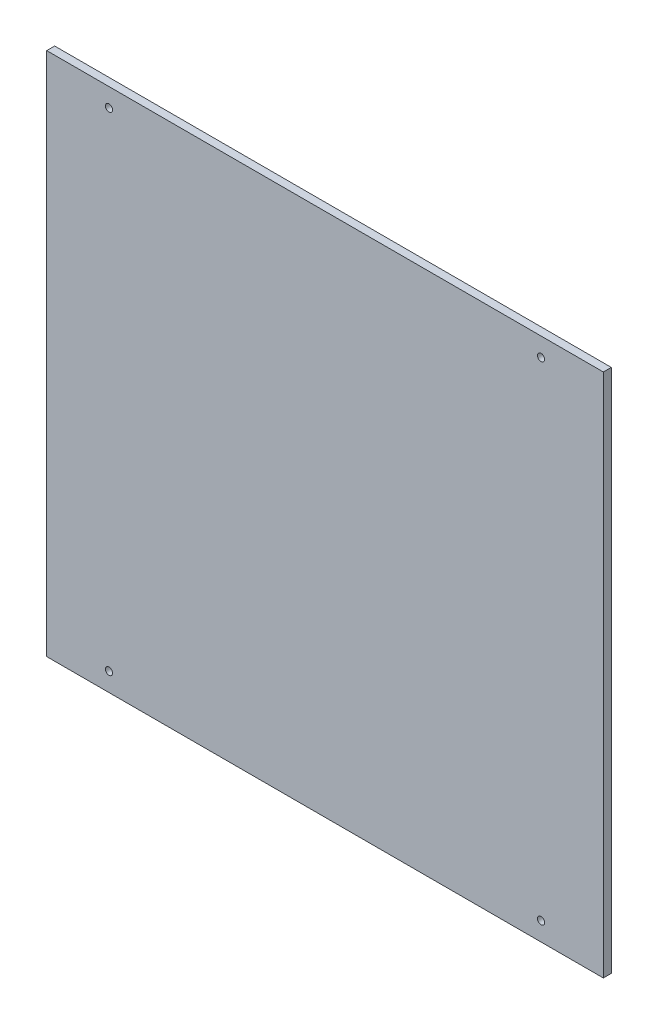
ISO-10303-21;
HEADER;
FILE_DESCRIPTION(('STEP AP214'),'2;1');
FILE_NAME('part.step','',(''),(''),'','','');
FILE_SCHEMA(('AUTOMOTIVE_DESIGN { 1 0 10303 214 1 1 1 1 }'));
ENDSEC;
DATA;
#1=APPLICATION_CONTEXT('core data for automotive mechanical design processes');
#2=APPLICATION_PROTOCOL_DEFINITION('international standard','automotive_design',2000,#1);
#3=PRODUCT_CONTEXT('',#1,'mechanical');
#4=PRODUCT('Part','Part','',(#3));
#5=PRODUCT_RELATED_PRODUCT_CATEGORY('part','',(#4));
#6=PRODUCT_DEFINITION_FORMATION('','',#4);
#7=PRODUCT_DEFINITION_CONTEXT('part definition',#1,'design');
#8=PRODUCT_DEFINITION('design','',#6,#7);
#9=PRODUCT_DEFINITION_SHAPE('','',#8);
#10=(LENGTH_UNIT() NAMED_UNIT(*) SI_UNIT(.MILLI.,.METRE.));
#11=(NAMED_UNIT(*) PLANE_ANGLE_UNIT() SI_UNIT($,.RADIAN.));
#12=(NAMED_UNIT(*) SI_UNIT($,.STERADIAN.) SOLID_ANGLE_UNIT());
#13=UNCERTAINTY_MEASURE_WITH_UNIT(LENGTH_MEASURE(1.E-05),#10,'distance_accuracy_value','');
#14=(GEOMETRIC_REPRESENTATION_CONTEXT(3) GLOBAL_UNCERTAINTY_ASSIGNED_CONTEXT((#13)) GLOBAL_UNIT_ASSIGNED_CONTEXT((#10,
#11,#12)) REPRESENTATION_CONTEXT('',''));
#15=CARTESIAN_POINT('',(0.,0.,0.));
#16=DIRECTION('',(0.,0.,1.));
#17=DIRECTION('',(1.,0.,0.));
#18=AXIS2_PLACEMENT_3D('',#15,#16,#17);
#19=CARTESIAN_POINT('',(105.,99.,3.));
#20=DIRECTION('',(-1.,0.,0.));
#21=DIRECTION('',(0.,-1.,0.));
#22=AXIS2_PLACEMENT_3D('',#19,#20,#21);
#23=PLANE('',#22);
#24=DIRECTION('',(0.,1.,0.));
#25=VECTOR('',#24,1.);
#26=CARTESIAN_POINT('',(105.,99.,0.));
#27=LINE('',#26,#25);
#28=CARTESIAN_POINT('',(105.,-99.,0.));
#29=VERTEX_POINT('',#28);
#30=CARTESIAN_POINT('',(105.,99.,0.));
#31=VERTEX_POINT('',#30);
#32=EDGE_CURVE('E96',#29,#31,#27,.T.);
#33=ORIENTED_EDGE('',*,*,#32,.T.);
#34=DIRECTION('',(0.,0.,-1.));
#35=VECTOR('',#34,1.);
#36=CARTESIAN_POINT('',(105.,99.,3.));
#37=LINE('',#36,#35);
#38=CARTESIAN_POINT('',(105.,99.,3.));
#39=VERTEX_POINT('',#38);
#40=EDGE_CURVE('E11',#39,#31,#37,.T.);
#41=ORIENTED_EDGE('',*,*,#40,.F.);
#42=DIRECTION('',(0.,1.,0.));
#43=VECTOR('',#42,1.);
#44=CARTESIAN_POINT('',(105.,99.,3.));
#45=LINE('',#44,#43);
#46=CARTESIAN_POINT('',(105.,-99.,3.));
#47=VERTEX_POINT('',#46);
#48=EDGE_CURVE('E84',#47,#39,#45,.T.);
#49=ORIENTED_EDGE('',*,*,#48,.F.);
#50=DIRECTION('',(0.,0.,-1.));
#51=VECTOR('',#50,1.);
#52=CARTESIAN_POINT('',(105.,-99.,3.));
#53=LINE('',#52,#51);
#54=EDGE_CURVE('E92',#47,#29,#53,.T.);
#55=ORIENTED_EDGE('',*,*,#54,.T.);
#56=EDGE_LOOP('',(#33,#41,#49,#55));
#57=FACE_BOUND('',#56,.T.);
#58=ADVANCED_FACE('F33',(#57),#23,.F.);
#59=CARTESIAN_POINT('',(-105.,99.,3.));
#60=DIRECTION('',(0.,-1.,0.));
#61=DIRECTION('',(0.,0.,-1.));
#62=AXIS2_PLACEMENT_3D('',#59,#60,#61);
#63=PLANE('',#62);
#64=DIRECTION('',(-1.,0.,0.));
#65=VECTOR('',#64,1.);
#66=CARTESIAN_POINT('',(-105.,99.,0.));
#67=LINE('',#66,#65);
#68=CARTESIAN_POINT('',(-105.,99.,0.));
#69=VERTEX_POINT('',#68);
#70=EDGE_CURVE('E88',#31,#69,#67,.T.);
#71=ORIENTED_EDGE('',*,*,#70,.T.);
#72=DIRECTION('',(0.,0.,-1.));
#73=VECTOR('',#72,1.);
#74=CARTESIAN_POINT('',(-105.,99.,3.));
#75=LINE('',#74,#73);
#76=CARTESIAN_POINT('',(-105.,99.,3.));
#77=VERTEX_POINT('',#76);
#78=EDGE_CURVE('E41',#77,#69,#75,.T.);
#79=ORIENTED_EDGE('',*,*,#78,.F.);
#80=DIRECTION('',(-1.,0.,0.));
#81=VECTOR('',#80,1.);
#82=CARTESIAN_POINT('',(-105.,99.,3.));
#83=LINE('',#82,#81);
#84=EDGE_CURVE('E79',#39,#77,#83,.T.);
#85=ORIENTED_EDGE('',*,*,#84,.F.);
#86=ORIENTED_EDGE('',*,*,#40,.T.);
#87=EDGE_LOOP('',(#71,#79,#85,#86));
#88=FACE_BOUND('',#87,.T.);
#89=ADVANCED_FACE('F87',(#88),#63,.F.);
#90=CARTESIAN_POINT('',(-105.,99.,3.));
#91=DIRECTION('',(1.,0.,0.));
#92=DIRECTION('',(0.,1.,0.));
#93=AXIS2_PLACEMENT_3D('',#90,#91,#92);
#94=PLANE('',#93);
#95=DIRECTION('',(0.,-1.,0.));
#96=VECTOR('',#95,1.);
#97=CARTESIAN_POINT('',(-105.,99.,0.));
#98=LINE('',#97,#96);
#99=CARTESIAN_POINT('',(-105.,-99.,0.));
#100=VERTEX_POINT('',#99);
#101=EDGE_CURVE('E66',#69,#100,#98,.T.);
#102=ORIENTED_EDGE('',*,*,#101,.T.);
#103=DIRECTION('',(0.,0.,-1.));
#104=VECTOR('',#103,1.);
#105=CARTESIAN_POINT('',(-105.,-99.,3.));
#106=LINE('',#105,#104);
#107=CARTESIAN_POINT('',(-105.,-99.,3.));
#108=VERTEX_POINT('',#107);
#109=EDGE_CURVE('E89',#108,#100,#106,.T.);
#110=ORIENTED_EDGE('',*,*,#109,.F.);
#111=DIRECTION('',(0.,-1.,0.));
#112=VECTOR('',#111,1.);
#113=CARTESIAN_POINT('',(-105.,99.,3.));
#114=LINE('',#113,#112);
#115=EDGE_CURVE('E82',#77,#108,#114,.T.);
#116=ORIENTED_EDGE('',*,*,#115,.F.);
#117=ORIENTED_EDGE('',*,*,#78,.T.);
#118=EDGE_LOOP('',(#102,#110,#116,#117));
#119=FACE_BOUND('',#118,.T.);
#120=ADVANCED_FACE('F90',(#119),#94,.F.);
#121=CARTESIAN_POINT('',(-105.,-99.,3.));
#122=DIRECTION('',(0.,1.,0.));
#123=DIRECTION('',(0.,0.,1.));
#124=AXIS2_PLACEMENT_3D('',#121,#122,#123);
#125=PLANE('',#124);
#126=DIRECTION('',(1.,0.,0.));
#127=VECTOR('',#126,1.);
#128=CARTESIAN_POINT('',(-105.,-99.,0.));
#129=LINE('',#128,#127);
#130=EDGE_CURVE('E72',#100,#29,#129,.T.);
#131=ORIENTED_EDGE('',*,*,#130,.T.);
#132=ORIENTED_EDGE('',*,*,#54,.F.);
#133=DIRECTION('',(1.,0.,0.));
#134=VECTOR('',#133,1.);
#135=CARTESIAN_POINT('',(-105.,-99.,3.));
#136=LINE('',#135,#134);
#137=EDGE_CURVE('E49',#108,#47,#136,.T.);
#138=ORIENTED_EDGE('',*,*,#137,.F.);
#139=ORIENTED_EDGE('',*,*,#109,.T.);
#140=EDGE_LOOP('',(#131,#132,#138,#139));
#141=FACE_BOUND('',#140,.T.);
#142=ADVANCED_FACE('F104',(#141),#125,.F.);
#143=CARTESIAN_POINT('',(0.,0.,3.));
#144=DIRECTION('',(0.,0.,1.));
#145=DIRECTION('',(1.,0.,0.));
#146=AXIS2_PLACEMENT_3D('',#143,#144,#145);
#147=PLANE('',#146);
#148=CARTESIAN_POINT('',(-81.5,-92.,3.));
#149=DIRECTION('',(0.,0.,1.));
#150=DIRECTION('',(1.,0.,0.));
#151=AXIS2_PLACEMENT_3D('',#148,#149,#150);
#152=CIRCLE('',#151,1.34999999999999);
#153=CARTESIAN_POINT('',(-80.15,-92.,3.));
#154=VERTEX_POINT('',#153);
#155=EDGE_CURVE('E130',#154,#154,#152,.T.);
#156=ORIENTED_EDGE('',*,*,#155,.F.);
#157=EDGE_LOOP('',(#156));
#158=FACE_BOUND('',#157,.T.);
#159=CARTESIAN_POINT('',(-81.5,92.,3.));
#160=DIRECTION('',(0.,0.,1.));
#161=DIRECTION('',(1.,0.,0.));
#162=AXIS2_PLACEMENT_3D('',#159,#160,#161);
#163=CIRCLE('',#162,1.34999999999999);
#164=CARTESIAN_POINT('',(-80.15,92.,3.));
#165=VERTEX_POINT('',#164);
#166=EDGE_CURVE('E124',#165,#165,#163,.T.);
#167=ORIENTED_EDGE('',*,*,#166,.F.);
#168=EDGE_LOOP('',(#167));
#169=FACE_BOUND('',#168,.T.);
#170=CARTESIAN_POINT('',(81.5,92.,3.));
#171=DIRECTION('',(0.,0.,1.));
#172=DIRECTION('',(1.,0.,0.));
#173=AXIS2_PLACEMENT_3D('',#170,#171,#172);
#174=CIRCLE('',#173,1.34999999999999);
#175=CARTESIAN_POINT('',(82.85,92.,3.));
#176=VERTEX_POINT('',#175);
#177=EDGE_CURVE('E118',#176,#176,#174,.T.);
#178=ORIENTED_EDGE('',*,*,#177,.F.);
#179=EDGE_LOOP('',(#178));
#180=FACE_BOUND('',#179,.T.);
#181=CARTESIAN_POINT('',(81.5,-92.,3.));
#182=DIRECTION('',(0.,0.,1.));
#183=DIRECTION('',(1.,0.,0.));
#184=AXIS2_PLACEMENT_3D('',#181,#182,#183);
#185=CIRCLE('',#184,1.34999999999999);
#186=CARTESIAN_POINT('',(82.85,-92.,3.));
#187=VERTEX_POINT('',#186);
#188=EDGE_CURVE('E112',#187,#187,#185,.T.);
#189=ORIENTED_EDGE('',*,*,#188,.F.);
#190=EDGE_LOOP('',(#189));
#191=FACE_BOUND('',#190,.T.);
#192=ORIENTED_EDGE('',*,*,#48,.T.);
#193=ORIENTED_EDGE('',*,*,#84,.T.);
#194=ORIENTED_EDGE('',*,*,#115,.T.);
#195=ORIENTED_EDGE('',*,*,#137,.T.);
#196=EDGE_LOOP('',(#192,#193,#194,#195));
#197=FACE_BOUND('',#196,.T.);
#198=ADVANCED_FACE('F80',(#158,#169,#180,#191,#197),#147,.T.);
#199=CARTESIAN_POINT('',(0.,0.,0.));
#200=DIRECTION('',(0.,0.,1.));
#201=DIRECTION('',(1.,0.,0.));
#202=AXIS2_PLACEMENT_3D('',#199,#200,#201);
#203=PLANE('',#202);
#204=CARTESIAN_POINT('',(-81.5,-92.,0.));
#205=DIRECTION('',(0.,0.,1.));
#206=DIRECTION('',(1.,0.,0.));
#207=AXIS2_PLACEMENT_3D('',#204,#205,#206);
#208=CIRCLE('',#207,1.35);
#209=CARTESIAN_POINT('',(-80.15,-92.,0.));
#210=VERTEX_POINT('',#209);
#211=EDGE_CURVE('E127',#210,#210,#208,.T.);
#212=ORIENTED_EDGE('',*,*,#211,.T.);
#213=EDGE_LOOP('',(#212));
#214=FACE_BOUND('',#213,.T.);
#215=CARTESIAN_POINT('',(-81.5,92.,0.));
#216=DIRECTION('',(0.,0.,1.));
#217=DIRECTION('',(1.,0.,0.));
#218=AXIS2_PLACEMENT_3D('',#215,#216,#217);
#219=CIRCLE('',#218,1.35);
#220=CARTESIAN_POINT('',(-80.15,92.,0.));
#221=VERTEX_POINT('',#220);
#222=EDGE_CURVE('E121',#221,#221,#219,.T.);
#223=ORIENTED_EDGE('',*,*,#222,.T.);
#224=EDGE_LOOP('',(#223));
#225=FACE_BOUND('',#224,.T.);
#226=CARTESIAN_POINT('',(81.5,92.,0.));
#227=DIRECTION('',(0.,0.,1.));
#228=DIRECTION('',(1.,0.,0.));
#229=AXIS2_PLACEMENT_3D('',#226,#227,#228);
#230=CIRCLE('',#229,1.35);
#231=CARTESIAN_POINT('',(82.85,92.,0.));
#232=VERTEX_POINT('',#231);
#233=EDGE_CURVE('E115',#232,#232,#230,.T.);
#234=ORIENTED_EDGE('',*,*,#233,.T.);
#235=EDGE_LOOP('',(#234));
#236=FACE_BOUND('',#235,.T.);
#237=CARTESIAN_POINT('',(81.5,-92.,0.));
#238=DIRECTION('',(0.,0.,1.));
#239=DIRECTION('',(1.,0.,0.));
#240=AXIS2_PLACEMENT_3D('',#237,#238,#239);
#241=CIRCLE('',#240,1.35);
#242=CARTESIAN_POINT('',(82.85,-92.,0.));
#243=VERTEX_POINT('',#242);
#244=EDGE_CURVE('E99',#243,#243,#241,.T.);
#245=ORIENTED_EDGE('',*,*,#244,.T.);
#246=EDGE_LOOP('',(#245));
#247=FACE_BOUND('',#246,.T.);
#248=ORIENTED_EDGE('',*,*,#32,.F.);
#249=ORIENTED_EDGE('',*,*,#130,.F.);
#250=ORIENTED_EDGE('',*,*,#101,.F.);
#251=ORIENTED_EDGE('',*,*,#70,.F.);
#252=EDGE_LOOP('',(#248,#249,#250,#251));
#253=FACE_BOUND('',#252,.T.);
#254=ADVANCED_FACE('F107',(#214,#225,#236,#247,#253),#203,.F.);
#255=CARTESIAN_POINT('',(81.5,-92.,3.));
#256=DIRECTION('',(0.,0.,1.));
#257=DIRECTION('',(1.,0.,0.));
#258=AXIS2_PLACEMENT_3D('',#255,#256,#257);
#259=CYLINDRICAL_SURFACE('',#258,1.35);
#260=ORIENTED_EDGE('',*,*,#244,.F.);
#261=EDGE_LOOP('',(#260));
#262=FACE_BOUND('',#261,.T.);
#263=ORIENTED_EDGE('',*,*,#188,.T.);
#264=EDGE_LOOP('',(#263));
#265=FACE_BOUND('',#264,.T.);
#266=ADVANCED_FACE('F145',(#262,#265),#259,.F.);
#267=CARTESIAN_POINT('',(81.5,92.,3.));
#268=DIRECTION('',(0.,0.,1.));
#269=DIRECTION('',(1.,0.,0.));
#270=AXIS2_PLACEMENT_3D('',#267,#268,#269);
#271=CYLINDRICAL_SURFACE('',#270,1.35);
#272=ORIENTED_EDGE('',*,*,#233,.F.);
#273=EDGE_LOOP('',(#272));
#274=FACE_BOUND('',#273,.T.);
#275=ORIENTED_EDGE('',*,*,#177,.T.);
#276=EDGE_LOOP('',(#275));
#277=FACE_BOUND('',#276,.T.);
#278=ADVANCED_FACE('F147',(#274,#277),#271,.F.);
#279=CARTESIAN_POINT('',(-81.5,92.,3.));
#280=DIRECTION('',(0.,0.,1.));
#281=DIRECTION('',(1.,0.,0.));
#282=AXIS2_PLACEMENT_3D('',#279,#280,#281);
#283=CYLINDRICAL_SURFACE('',#282,1.35);
#284=ORIENTED_EDGE('',*,*,#222,.F.);
#285=EDGE_LOOP('',(#284));
#286=FACE_BOUND('',#285,.T.);
#287=ORIENTED_EDGE('',*,*,#166,.T.);
#288=EDGE_LOOP('',(#287));
#289=FACE_BOUND('',#288,.T.);
#290=ADVANCED_FACE('F154',(#286,#289),#283,.F.);
#291=CARTESIAN_POINT('',(-81.5,-92.,3.));
#292=DIRECTION('',(0.,0.,1.));
#293=DIRECTION('',(1.,0.,0.));
#294=AXIS2_PLACEMENT_3D('',#291,#292,#293);
#295=CYLINDRICAL_SURFACE('',#294,1.35);
#296=ORIENTED_EDGE('',*,*,#211,.F.);
#297=EDGE_LOOP('',(#296));
#298=FACE_BOUND('',#297,.T.);
#299=ORIENTED_EDGE('',*,*,#155,.T.);
#300=EDGE_LOOP('',(#299));
#301=FACE_BOUND('',#300,.T.);
#302=ADVANCED_FACE('F134',(#298,#301),#295,.F.);
#303=CLOSED_SHELL('',(#58,#89,#120,#142,#198,#254,#266,#278,#290,#302));
#304=MANIFOLD_SOLID_BREP('B2',#303);
#305=ADVANCED_BREP_SHAPE_REPRESENTATION('',(#18,#304),#14);
#306=SHAPE_DEFINITION_REPRESENTATION(#9,#305);
ENDSEC;
END-ISO-10303-21;
